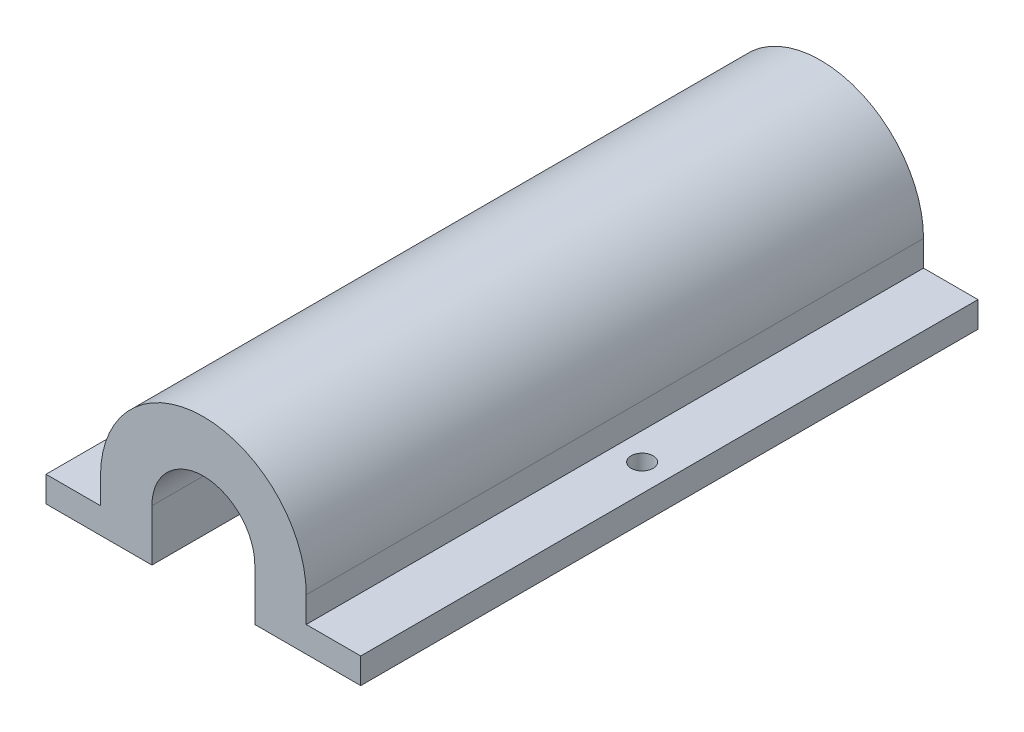
ISO-10303-21;
HEADER;
FILE_DESCRIPTION(('STEP AP214'),'2;1');
FILE_NAME('part.step','',(''),(''),'','','');
FILE_SCHEMA(('AUTOMOTIVE_DESIGN { 1 0 10303 214 1 1 1 1 }'));
ENDSEC;
DATA;
#1=APPLICATION_CONTEXT('core data for automotive mechanical design processes');
#2=APPLICATION_PROTOCOL_DEFINITION('international standard','automotive_design',2000,#1);
#3=PRODUCT_CONTEXT('',#1,'mechanical');
#4=PRODUCT('Part','Part','',(#3));
#5=PRODUCT_RELATED_PRODUCT_CATEGORY('part','',(#4));
#6=PRODUCT_DEFINITION_FORMATION('','',#4);
#7=PRODUCT_DEFINITION_CONTEXT('part definition',#1,'design');
#8=PRODUCT_DEFINITION('design','',#6,#7);
#9=PRODUCT_DEFINITION_SHAPE('','',#8);
#10=(LENGTH_UNIT() NAMED_UNIT(*) SI_UNIT(.MILLI.,.METRE.));
#11=(NAMED_UNIT(*) PLANE_ANGLE_UNIT() SI_UNIT($,.RADIAN.));
#12=(NAMED_UNIT(*) SI_UNIT($,.STERADIAN.) SOLID_ANGLE_UNIT());
#13=UNCERTAINTY_MEASURE_WITH_UNIT(LENGTH_MEASURE(1.E-05),#10,'distance_accuracy_value','');
#14=(GEOMETRIC_REPRESENTATION_CONTEXT(3) GLOBAL_UNCERTAINTY_ASSIGNED_CONTEXT((#13)) GLOBAL_UNIT_ASSIGNED_CONTEXT((#10,
#11,#12)) REPRESENTATION_CONTEXT('',''));
#15=CARTESIAN_POINT('',(0.,0.,0.));
#16=DIRECTION('',(0.,0.,1.));
#17=DIRECTION('',(1.,0.,0.));
#18=AXIS2_PLACEMENT_3D('',#15,#16,#17);
#19=CARTESIAN_POINT('',(-12.7,-3.175,76.2));
#20=DIRECTION('',(1.,0.,0.));
#21=DIRECTION('',(0.,0.,-1.));
#22=AXIS2_PLACEMENT_3D('',#19,#20,#21);
#23=PLANE('',#22);
#24=DIRECTION('',(0.,-1.,0.));
#25=VECTOR('',#24,1.);
#26=CARTESIAN_POINT('',(-12.7,-3.175,0.));
#27=LINE('',#26,#25);
#28=CARTESIAN_POINT('',(-12.7,0.,0.));
#29=VERTEX_POINT('',#28);
#30=CARTESIAN_POINT('',(-12.7,-3.175,0.));
#31=VERTEX_POINT('',#30);
#32=EDGE_CURVE('E164',#29,#31,#27,.T.);
#33=ORIENTED_EDGE('',*,*,#32,.T.);
#34=DIRECTION('',(0.,0.,-1.));
#35=VECTOR('',#34,1.);
#36=CARTESIAN_POINT('',(-12.7,-3.175,76.2));
#37=LINE('',#36,#35);
#38=CARTESIAN_POINT('',(-12.7,-3.175,76.2));
#39=VERTEX_POINT('',#38);
#40=EDGE_CURVE('E11',#39,#31,#37,.T.);
#41=ORIENTED_EDGE('',*,*,#40,.F.);
#42=DIRECTION('',(0.,-1.,0.));
#43=VECTOR('',#42,1.);
#44=CARTESIAN_POINT('',(-12.7,-3.175,76.2));
#45=LINE('',#44,#43);
#46=CARTESIAN_POINT('',(-12.7,0.,76.2));
#47=VERTEX_POINT('',#46);
#48=EDGE_CURVE('E199',#47,#39,#45,.T.);
#49=ORIENTED_EDGE('',*,*,#48,.F.);
#50=DIRECTION('',(0.,0.,-1.));
#51=VECTOR('',#50,1.);
#52=CARTESIAN_POINT('',(-12.7,0.,76.2));
#53=LINE('',#52,#51);
#54=EDGE_CURVE('E160',#47,#29,#53,.T.);
#55=ORIENTED_EDGE('',*,*,#54,.T.);
#56=EDGE_LOOP('',(#33,#41,#49,#55));
#57=FACE_BOUND('',#56,.T.);
#58=ADVANCED_FACE('F39',(#57),#23,.F.);
#59=CARTESIAN_POINT('',(-19.4258996107139,-3.175,76.2));
#60=DIRECTION('',(0.,-1.,0.));
#61=DIRECTION('',(0.,0.,-1.));
#62=AXIS2_PLACEMENT_3D('',#59,#60,#61);
#63=PLANE('',#62);
#64=CARTESIAN_POINT('',(-16.0629498053569,-3.175,38.1));
#65=DIRECTION('',(0.,1.,0.));
#66=DIRECTION('',(0.,0.,1.));
#67=AXIS2_PLACEMENT_3D('',#64,#65,#66);
#68=CIRCLE('',#67,1.35255);
#69=CARTESIAN_POINT('',(-16.0629498053569,-3.175,39.45255));
#70=VERTEX_POINT('',#69);
#71=EDGE_CURVE('E338',#70,#70,#68,.T.);
#72=ORIENTED_EDGE('',*,*,#71,.F.);
#73=EDGE_LOOP('',(#72));
#74=FACE_BOUND('',#73,.T.);
#75=DIRECTION('',(-1.,0.,0.));
#76=VECTOR('',#75,1.);
#77=CARTESIAN_POINT('',(-19.4258996107139,-3.175,0.));
#78=LINE('',#77,#76);
#79=CARTESIAN_POINT('',(-19.4258996107139,-3.175,0.));
#80=VERTEX_POINT('',#79);
#81=EDGE_CURVE('E168',#31,#80,#78,.T.);
#82=ORIENTED_EDGE('',*,*,#81,.T.);
#83=DIRECTION('',(0.,0.,-1.));
#84=VECTOR('',#83,1.);
#85=CARTESIAN_POINT('',(-19.4258996107139,-3.175,76.2));
#86=LINE('',#85,#84);
#87=CARTESIAN_POINT('',(-19.4258996107139,-3.175,76.2));
#88=VERTEX_POINT('',#87);
#89=EDGE_CURVE('E48',#88,#80,#86,.T.);
#90=ORIENTED_EDGE('',*,*,#89,.F.);
#91=DIRECTION('',(-1.,0.,0.));
#92=VECTOR('',#91,1.);
#93=CARTESIAN_POINT('',(-19.4258996107139,-3.175,76.2));
#94=LINE('',#93,#92);
#95=EDGE_CURVE('E111',#39,#88,#94,.T.);
#96=ORIENTED_EDGE('',*,*,#95,.F.);
#97=ORIENTED_EDGE('',*,*,#40,.T.);
#98=EDGE_LOOP('',(#82,#90,#96,#97));
#99=FACE_BOUND('',#98,.T.);
#100=ADVANCED_FACE('F293',(#74,#99),#63,.F.);
#101=CARTESIAN_POINT('',(-19.4258996107139,-6.35,76.2));
#102=DIRECTION('',(1.,0.,0.));
#103=DIRECTION('',(0.,0.,-1.));
#104=AXIS2_PLACEMENT_3D('',#101,#102,#103);
#105=PLANE('',#104);
#106=DIRECTION('',(0.,-1.,0.));
#107=VECTOR('',#106,1.);
#108=CARTESIAN_POINT('',(-19.4258996107139,-6.35,0.));
#109=LINE('',#108,#107);
#110=CARTESIAN_POINT('',(-19.4258996107139,-6.35,0.));
#111=VERTEX_POINT('',#110);
#112=EDGE_CURVE('E172',#80,#111,#109,.T.);
#113=ORIENTED_EDGE('',*,*,#112,.T.);
#114=DIRECTION('',(0.,0.,-1.));
#115=VECTOR('',#114,1.);
#116=CARTESIAN_POINT('',(-19.4258996107139,-6.35,76.2));
#117=LINE('',#116,#115);
#118=CARTESIAN_POINT('',(-19.4258996107139,-6.35,76.2));
#119=VERTEX_POINT('',#118);
#120=EDGE_CURVE('E226',#119,#111,#117,.T.);
#121=ORIENTED_EDGE('',*,*,#120,.F.);
#122=DIRECTION('',(0.,-1.,0.));
#123=VECTOR('',#122,1.);
#124=CARTESIAN_POINT('',(-19.4258996107139,-6.35,76.2));
#125=LINE('',#124,#123);
#126=EDGE_CURVE('E236',#88,#119,#125,.T.);
#127=ORIENTED_EDGE('',*,*,#126,.F.);
#128=ORIENTED_EDGE('',*,*,#89,.T.);
#129=EDGE_LOOP('',(#113,#121,#127,#128));
#130=FACE_BOUND('',#129,.T.);
#131=ADVANCED_FACE('F234',(#130),#105,.F.);
#132=CARTESIAN_POINT('',(-19.4258996107139,-6.35,76.2));
#133=DIRECTION('',(0.,1.,0.));
#134=DIRECTION('',(-1.,0.,0.));
#135=AXIS2_PLACEMENT_3D('',#132,#133,#134);
#136=PLANE('',#135);
#137=CARTESIAN_POINT('',(-16.0629498053569,-6.35,38.1));
#138=DIRECTION('',(0.,1.,0.));
#139=DIRECTION('',(0.,0.,1.));
#140=AXIS2_PLACEMENT_3D('',#137,#138,#139);
#141=CIRCLE('',#140,1.35255);
#142=CARTESIAN_POINT('',(-16.0629498053569,-6.35,39.45255));
#143=VERTEX_POINT('',#142);
#144=EDGE_CURVE('E331',#143,#143,#141,.T.);
#145=ORIENTED_EDGE('',*,*,#144,.T.);
#146=EDGE_LOOP('',(#145));
#147=FACE_BOUND('',#146,.T.);
#148=DIRECTION('',(1.,0.,0.));
#149=VECTOR('',#148,1.);
#150=CARTESIAN_POINT('',(-19.4258996107139,-6.35,0.));
#151=LINE('',#150,#149);
#152=CARTESIAN_POINT('',(-6.35,-6.35,0.));
#153=VERTEX_POINT('',#152);
#154=EDGE_CURVE('E175',#111,#153,#151,.T.);
#155=ORIENTED_EDGE('',*,*,#154,.T.);
#156=DIRECTION('',(0.,0.,-1.));
#157=VECTOR('',#156,1.);
#158=CARTESIAN_POINT('',(-6.35,-6.35,76.2));
#159=LINE('',#158,#157);
#160=CARTESIAN_POINT('',(-6.35,-6.35,76.2));
#161=VERTEX_POINT('',#160);
#162=EDGE_CURVE('E222',#161,#153,#159,.T.);
#163=ORIENTED_EDGE('',*,*,#162,.F.);
#164=DIRECTION('',(1.,0.,0.));
#165=VECTOR('',#164,1.);
#166=CARTESIAN_POINT('',(-19.4258996107139,-6.35,76.2));
#167=LINE('',#166,#165);
#168=EDGE_CURVE('E255',#119,#161,#167,.T.);
#169=ORIENTED_EDGE('',*,*,#168,.F.);
#170=ORIENTED_EDGE('',*,*,#120,.T.);
#171=EDGE_LOOP('',(#155,#163,#169,#170));
#172=FACE_BOUND('',#171,.T.);
#173=ADVANCED_FACE('F245',(#147,#172),#136,.F.);
#174=CARTESIAN_POINT('',(-6.35,0.,76.2));
#175=DIRECTION('',(-1.,0.,0.));
#176=DIRECTION('',(0.,0.,1.));
#177=AXIS2_PLACEMENT_3D('',#174,#175,#176);
#178=PLANE('',#177);
#179=DIRECTION('',(0.,1.,0.));
#180=VECTOR('',#179,1.);
#181=CARTESIAN_POINT('',(-6.35,0.,0.));
#182=LINE('',#181,#180);
#183=CARTESIAN_POINT('',(-6.35,0.,0.));
#184=VERTEX_POINT('',#183);
#185=EDGE_CURVE('E178',#153,#184,#182,.T.);
#186=ORIENTED_EDGE('',*,*,#185,.T.);
#187=DIRECTION('',(0.,0.,-1.));
#188=VECTOR('',#187,1.);
#189=CARTESIAN_POINT('',(-6.35,0.,76.2));
#190=LINE('',#189,#188);
#191=CARTESIAN_POINT('',(-6.35,0.,76.2));
#192=VERTEX_POINT('',#191);
#193=EDGE_CURVE('E218',#192,#184,#190,.T.);
#194=ORIENTED_EDGE('',*,*,#193,.F.);
#195=DIRECTION('',(0.,1.,0.));
#196=VECTOR('',#195,1.);
#197=CARTESIAN_POINT('',(-6.35,0.,76.2));
#198=LINE('',#197,#196);
#199=EDGE_CURVE('E251',#161,#192,#198,.T.);
#200=ORIENTED_EDGE('',*,*,#199,.F.);
#201=ORIENTED_EDGE('',*,*,#162,.T.);
#202=EDGE_LOOP('',(#186,#194,#200,#201));
#203=FACE_BOUND('',#202,.T.);
#204=ADVANCED_FACE('F249',(#203),#178,.F.);
#205=CARTESIAN_POINT('',(0.,0.,76.2));
#206=DIRECTION('',(0.,0.,-1.));
#207=DIRECTION('',(-1.,0.,0.));
#208=AXIS2_PLACEMENT_3D('',#205,#206,#207);
#209=CYLINDRICAL_SURFACE('',#208,6.35);
#210=CARTESIAN_POINT('',(0.,0.,0.));
#211=DIRECTION('',(0.,0.,-1.));
#212=DIRECTION('',(1.,0.,0.));
#213=AXIS2_PLACEMENT_3D('',#210,#211,#212);
#214=CIRCLE('',#213,6.35);
#215=CARTESIAN_POINT('',(6.35,0.,0.));
#216=VERTEX_POINT('',#215);
#217=EDGE_CURVE('E181',#184,#216,#214,.T.);
#218=ORIENTED_EDGE('',*,*,#217,.T.);
#219=DIRECTION('',(0.,0.,-1.));
#220=VECTOR('',#219,1.);
#221=CARTESIAN_POINT('',(6.35,0.,76.2));
#222=LINE('',#221,#220);
#223=CARTESIAN_POINT('',(6.35,0.,76.2));
#224=VERTEX_POINT('',#223);
#225=EDGE_CURVE('E214',#224,#216,#222,.T.);
#226=ORIENTED_EDGE('',*,*,#225,.F.);
#227=CARTESIAN_POINT('',(0.,0.,76.2));
#228=DIRECTION('',(0.,0.,-1.));
#229=DIRECTION('',(1.,0.,0.));
#230=AXIS2_PLACEMENT_3D('',#227,#228,#229);
#231=CIRCLE('',#230,6.35);
#232=EDGE_CURVE('E254',#192,#224,#231,.T.);
#233=ORIENTED_EDGE('',*,*,#232,.F.);
#234=ORIENTED_EDGE('',*,*,#193,.T.);
#235=EDGE_LOOP('',(#218,#226,#233,#234));
#236=FACE_BOUND('',#235,.T.);
#237=ADVANCED_FACE('F309',(#236),#209,.F.);
#238=CARTESIAN_POINT('',(6.35,0.,76.2));
#239=DIRECTION('',(1.,0.,0.));
#240=DIRECTION('',(0.,1.,0.));
#241=AXIS2_PLACEMENT_3D('',#238,#239,#240);
#242=PLANE('',#241);
#243=DIRECTION('',(0.,-1.,0.));
#244=VECTOR('',#243,1.);
#245=CARTESIAN_POINT('',(6.35,0.,0.));
#246=LINE('',#245,#244);
#247=CARTESIAN_POINT('',(6.35,-6.35,0.));
#248=VERTEX_POINT('',#247);
#249=EDGE_CURVE('E184',#216,#248,#246,.T.);
#250=ORIENTED_EDGE('',*,*,#249,.T.);
#251=DIRECTION('',(0.,0.,-1.));
#252=VECTOR('',#251,1.);
#253=CARTESIAN_POINT('',(6.35,-6.35,76.2));
#254=LINE('',#253,#252);
#255=CARTESIAN_POINT('',(6.35,-6.35,76.2));
#256=VERTEX_POINT('',#255);
#257=EDGE_CURVE('E210',#256,#248,#254,.T.);
#258=ORIENTED_EDGE('',*,*,#257,.F.);
#259=DIRECTION('',(0.,-1.,0.));
#260=VECTOR('',#259,1.);
#261=CARTESIAN_POINT('',(6.35,0.,76.2));
#262=LINE('',#261,#260);
#263=EDGE_CURVE('E259',#224,#256,#262,.T.);
#264=ORIENTED_EDGE('',*,*,#263,.F.);
#265=ORIENTED_EDGE('',*,*,#225,.T.);
#266=EDGE_LOOP('',(#250,#258,#264,#265));
#267=FACE_BOUND('',#266,.T.);
#268=ADVANCED_FACE('F312',(#267),#242,.F.);
#269=CARTESIAN_POINT('',(6.35,-6.35,76.2));
#270=DIRECTION('',(0.,1.,0.));
#271=DIRECTION('',(-1.,0.,0.));
#272=AXIS2_PLACEMENT_3D('',#269,#270,#271);
#273=PLANE('',#272);
#274=CARTESIAN_POINT('',(16.0629498053569,-6.35,38.1));
#275=DIRECTION('',(0.,1.,0.));
#276=DIRECTION('',(0.,0.,1.));
#277=AXIS2_PLACEMENT_3D('',#274,#275,#276);
#278=CIRCLE('',#277,1.35255);
#279=CARTESIAN_POINT('',(16.0629498053569,-6.35,39.45255));
#280=VERTEX_POINT('',#279);
#281=EDGE_CURVE('E169',#280,#280,#278,.T.);
#282=ORIENTED_EDGE('',*,*,#281,.T.);
#283=EDGE_LOOP('',(#282));
#284=FACE_BOUND('',#283,.T.);
#285=DIRECTION('',(1.,0.,0.));
#286=VECTOR('',#285,1.);
#287=CARTESIAN_POINT('',(6.35,-6.35,0.));
#288=LINE('',#287,#286);
#289=CARTESIAN_POINT('',(19.4258996107139,-6.34999999999999,0.));
#290=VERTEX_POINT('',#289);
#291=EDGE_CURVE('E187',#248,#290,#288,.T.);
#292=ORIENTED_EDGE('',*,*,#291,.T.);
#293=DIRECTION('',(0.,0.,-1.));
#294=VECTOR('',#293,1.);
#295=CARTESIAN_POINT('',(19.4258996107139,-6.34999999999999,76.2));
#296=LINE('',#295,#294);
#297=CARTESIAN_POINT('',(19.4258996107139,-6.34999999999999,76.2));
#298=VERTEX_POINT('',#297);
#299=EDGE_CURVE('E206',#298,#290,#296,.T.);
#300=ORIENTED_EDGE('',*,*,#299,.F.);
#301=DIRECTION('',(1.,0.,0.));
#302=VECTOR('',#301,1.);
#303=CARTESIAN_POINT('',(6.35,-6.35,76.2));
#304=LINE('',#303,#302);
#305=EDGE_CURVE('E266',#256,#298,#304,.T.);
#306=ORIENTED_EDGE('',*,*,#305,.F.);
#307=ORIENTED_EDGE('',*,*,#257,.T.);
#308=EDGE_LOOP('',(#292,#300,#306,#307));
#309=FACE_BOUND('',#308,.T.);
#310=ADVANCED_FACE('F274',(#284,#309),#273,.F.);
#311=CARTESIAN_POINT('',(19.4258996107139,-6.34999999999999,76.2));
#312=DIRECTION('',(-1.,0.,0.));
#313=DIRECTION('',(0.,0.,1.));
#314=AXIS2_PLACEMENT_3D('',#311,#312,#313);
#315=PLANE('',#314);
#316=DIRECTION('',(0.,1.,0.));
#317=VECTOR('',#316,1.);
#318=CARTESIAN_POINT('',(19.4258996107139,-6.34999999999999,0.));
#319=LINE('',#318,#317);
#320=CARTESIAN_POINT('',(19.4258996107139,-3.175,0.));
#321=VERTEX_POINT('',#320);
#322=EDGE_CURVE('E190',#290,#321,#319,.T.);
#323=ORIENTED_EDGE('',*,*,#322,.T.);
#324=DIRECTION('',(0.,0.,-1.));
#325=VECTOR('',#324,1.);
#326=CARTESIAN_POINT('',(19.4258996107139,-3.175,76.2));
#327=LINE('',#326,#325);
#328=CARTESIAN_POINT('',(19.4258996107139,-3.175,76.2));
#329=VERTEX_POINT('',#328);
#330=EDGE_CURVE('E153',#329,#321,#327,.T.);
#331=ORIENTED_EDGE('',*,*,#330,.F.);
#332=DIRECTION('',(0.,1.,0.));
#333=VECTOR('',#332,1.);
#334=CARTESIAN_POINT('',(19.4258996107139,-6.34999999999999,76.2));
#335=LINE('',#334,#333);
#336=EDGE_CURVE('E142',#298,#329,#335,.T.);
#337=ORIENTED_EDGE('',*,*,#336,.F.);
#338=ORIENTED_EDGE('',*,*,#299,.T.);
#339=EDGE_LOOP('',(#323,#331,#337,#338));
#340=FACE_BOUND('',#339,.T.);
#341=ADVANCED_FACE('F278',(#340),#315,.F.);
#342=CARTESIAN_POINT('',(19.4258996107139,-3.175,76.2));
#343=DIRECTION('',(0.,-1.,0.));
#344=DIRECTION('',(0.,0.,-1.));
#345=AXIS2_PLACEMENT_3D('',#342,#343,#344);
#346=PLANE('',#345);
#347=CARTESIAN_POINT('',(16.0629498053569,-3.175,38.1));
#348=DIRECTION('',(0.,1.,0.));
#349=DIRECTION('',(0.,0.,1.));
#350=AXIS2_PLACEMENT_3D('',#347,#348,#349);
#351=CIRCLE('',#350,1.35255);
#352=CARTESIAN_POINT('',(16.0629498053569,-3.175,39.45255));
#353=VERTEX_POINT('',#352);
#354=EDGE_CURVE('E328',#353,#353,#351,.T.);
#355=ORIENTED_EDGE('',*,*,#354,.F.);
#356=EDGE_LOOP('',(#355));
#357=FACE_BOUND('',#356,.T.);
#358=DIRECTION('',(-1.,0.,0.));
#359=VECTOR('',#358,1.);
#360=CARTESIAN_POINT('',(19.4258996107139,-3.175,0.));
#361=LINE('',#360,#359);
#362=CARTESIAN_POINT('',(12.7,-3.175,0.));
#363=VERTEX_POINT('',#362);
#364=EDGE_CURVE('E151',#321,#363,#361,.T.);
#365=ORIENTED_EDGE('',*,*,#364,.T.);
#366=DIRECTION('',(0.,0.,-1.));
#367=VECTOR('',#366,1.);
#368=CARTESIAN_POINT('',(12.7,-3.175,76.2));
#369=LINE('',#368,#367);
#370=CARTESIAN_POINT('',(12.7,-3.175,76.2));
#371=VERTEX_POINT('',#370);
#372=EDGE_CURVE('E148',#371,#363,#369,.T.);
#373=ORIENTED_EDGE('',*,*,#372,.F.);
#374=DIRECTION('',(-1.,0.,0.));
#375=VECTOR('',#374,1.);
#376=CARTESIAN_POINT('',(19.4258996107139,-3.175,76.2));
#377=LINE('',#376,#375);
#378=EDGE_CURVE('E136',#329,#371,#377,.T.);
#379=ORIENTED_EDGE('',*,*,#378,.F.);
#380=ORIENTED_EDGE('',*,*,#330,.T.);
#381=EDGE_LOOP('',(#365,#373,#379,#380));
#382=FACE_BOUND('',#381,.T.);
#383=ADVANCED_FACE('F149',(#357,#382),#346,.F.);
#384=CARTESIAN_POINT('',(12.7,-3.175,76.2));
#385=DIRECTION('',(-1.,0.,0.));
#386=DIRECTION('',(0.,0.,1.));
#387=AXIS2_PLACEMENT_3D('',#384,#385,#386);
#388=PLANE('',#387);
#389=DIRECTION('',(0.,1.,0.));
#390=VECTOR('',#389,1.);
#391=CARTESIAN_POINT('',(12.7,-3.175,0.));
#392=LINE('',#391,#390);
#393=CARTESIAN_POINT('',(12.7,0.,0.));
#394=VERTEX_POINT('',#393);
#395=EDGE_CURVE('E97',#363,#394,#392,.T.);
#396=ORIENTED_EDGE('',*,*,#395,.T.);
#397=DIRECTION('',(0.,0.,-1.));
#398=VECTOR('',#397,1.);
#399=CARTESIAN_POINT('',(12.7,0.,76.2));
#400=LINE('',#399,#398);
#401=CARTESIAN_POINT('',(12.7,0.,76.2));
#402=VERTEX_POINT('',#401);
#403=EDGE_CURVE('E154',#402,#394,#400,.T.);
#404=ORIENTED_EDGE('',*,*,#403,.F.);
#405=DIRECTION('',(0.,1.,0.));
#406=VECTOR('',#405,1.);
#407=CARTESIAN_POINT('',(12.7,-3.175,76.2));
#408=LINE('',#407,#406);
#409=EDGE_CURVE('E140',#371,#402,#408,.T.);
#410=ORIENTED_EDGE('',*,*,#409,.F.);
#411=ORIENTED_EDGE('',*,*,#372,.T.);
#412=EDGE_LOOP('',(#396,#404,#410,#411));
#413=FACE_BOUND('',#412,.T.);
#414=ADVANCED_FACE('F156',(#413),#388,.F.);
#415=CARTESIAN_POINT('',(0.,0.,76.2));
#416=DIRECTION('',(0.,0.,-1.));
#417=DIRECTION('',(-1.,0.,0.));
#418=AXIS2_PLACEMENT_3D('',#415,#416,#417);
#419=CYLINDRICAL_SURFACE('',#418,12.7);
#420=CARTESIAN_POINT('',(0.,0.,0.));
#421=DIRECTION('',(0.,0.,1.));
#422=DIRECTION('',(1.,0.,0.));
#423=AXIS2_PLACEMENT_3D('',#420,#421,#422);
#424=CIRCLE('',#423,12.7);
#425=EDGE_CURVE('E103',#394,#29,#424,.T.);
#426=ORIENTED_EDGE('',*,*,#425,.T.);
#427=ORIENTED_EDGE('',*,*,#54,.F.);
#428=CARTESIAN_POINT('',(0.,0.,76.2));
#429=DIRECTION('',(0.,0.,1.));
#430=DIRECTION('',(1.,0.,0.));
#431=AXIS2_PLACEMENT_3D('',#428,#429,#430);
#432=CIRCLE('',#431,12.7);
#433=EDGE_CURVE('E56',#402,#47,#432,.T.);
#434=ORIENTED_EDGE('',*,*,#433,.F.);
#435=ORIENTED_EDGE('',*,*,#403,.T.);
#436=EDGE_LOOP('',(#426,#427,#434,#435));
#437=FACE_BOUND('',#436,.T.);
#438=ADVANCED_FACE('F282',(#437),#419,.T.);
#439=CARTESIAN_POINT('',(0.,0.,76.2));
#440=DIRECTION('',(0.,0.,1.));
#441=DIRECTION('',(1.,0.,0.));
#442=AXIS2_PLACEMENT_3D('',#439,#440,#441);
#443=PLANE('',#442);
#444=ORIENTED_EDGE('',*,*,#48,.T.);
#445=ORIENTED_EDGE('',*,*,#95,.T.);
#446=ORIENTED_EDGE('',*,*,#126,.T.);
#447=ORIENTED_EDGE('',*,*,#168,.T.);
#448=ORIENTED_EDGE('',*,*,#199,.T.);
#449=ORIENTED_EDGE('',*,*,#232,.T.);
#450=ORIENTED_EDGE('',*,*,#263,.T.);
#451=ORIENTED_EDGE('',*,*,#305,.T.);
#452=ORIENTED_EDGE('',*,*,#336,.T.);
#453=ORIENTED_EDGE('',*,*,#378,.T.);
#454=ORIENTED_EDGE('',*,*,#409,.T.);
#455=ORIENTED_EDGE('',*,*,#433,.T.);
#456=EDGE_LOOP('',(#444,#445,#446,#447,#448,#449,#450,#451,#452,#453,#454,#455));
#457=FACE_BOUND('',#456,.T.);
#458=ADVANCED_FACE('F138',(#457),#443,.T.);
#459=CARTESIAN_POINT('',(0.,0.,0.));
#460=DIRECTION('',(0.,0.,1.));
#461=DIRECTION('',(1.,0.,0.));
#462=AXIS2_PLACEMENT_3D('',#459,#460,#461);
#463=PLANE('',#462);
#464=ORIENTED_EDGE('',*,*,#32,.F.);
#465=ORIENTED_EDGE('',*,*,#425,.F.);
#466=ORIENTED_EDGE('',*,*,#395,.F.);
#467=ORIENTED_EDGE('',*,*,#364,.F.);
#468=ORIENTED_EDGE('',*,*,#322,.F.);
#469=ORIENTED_EDGE('',*,*,#291,.F.);
#470=ORIENTED_EDGE('',*,*,#249,.F.);
#471=ORIENTED_EDGE('',*,*,#217,.F.);
#472=ORIENTED_EDGE('',*,*,#185,.F.);
#473=ORIENTED_EDGE('',*,*,#154,.F.);
#474=ORIENTED_EDGE('',*,*,#112,.F.);
#475=ORIENTED_EDGE('',*,*,#81,.F.);
#476=EDGE_LOOP('',(#464,#465,#466,#467,#468,#469,#470,#471,#472,#473,#474,#475));
#477=FACE_BOUND('',#476,.T.);
#478=ADVANCED_FACE('F240',(#477),#463,.F.);
#479=CARTESIAN_POINT('',(16.0629498053569,-3.175,38.1));
#480=DIRECTION('',(0.,1.,0.));
#481=DIRECTION('',(0.,0.,1.));
#482=AXIS2_PLACEMENT_3D('',#479,#480,#481);
#483=CYLINDRICAL_SURFACE('',#482,1.35255);
#484=ORIENTED_EDGE('',*,*,#281,.F.);
#485=EDGE_LOOP('',(#484));
#486=FACE_BOUND('',#485,.T.);
#487=ORIENTED_EDGE('',*,*,#354,.T.);
#488=EDGE_LOOP('',(#487));
#489=FACE_BOUND('',#488,.T.);
#490=ADVANCED_FACE('F351',(#486,#489),#483,.F.);
#491=CARTESIAN_POINT('',(-16.0629498053569,-3.175,38.1));
#492=DIRECTION('',(0.,1.,0.));
#493=DIRECTION('',(0.,0.,1.));
#494=AXIS2_PLACEMENT_3D('',#491,#492,#493);
#495=CYLINDRICAL_SURFACE('',#494,1.35255);
#496=ORIENTED_EDGE('',*,*,#144,.F.);
#497=EDGE_LOOP('',(#496));
#498=FACE_BOUND('',#497,.T.);
#499=ORIENTED_EDGE('',*,*,#71,.T.);
#500=EDGE_LOOP('',(#499));
#501=FACE_BOUND('',#500,.T.);
#502=ADVANCED_FACE('F349',(#498,#501),#495,.F.);
#503=CLOSED_SHELL('',(#58,#100,#131,#173,#204,#237,#268,#310,#341,#383,#414,#438,#458,#478,#490,#502));
#504=MANIFOLD_SOLID_BREP('B2',#503);
#505=ADVANCED_BREP_SHAPE_REPRESENTATION('',(#18,#504),#14);
#506=SHAPE_DEFINITION_REPRESENTATION(#9,#505);
ENDSEC;
END-ISO-10303-21;
